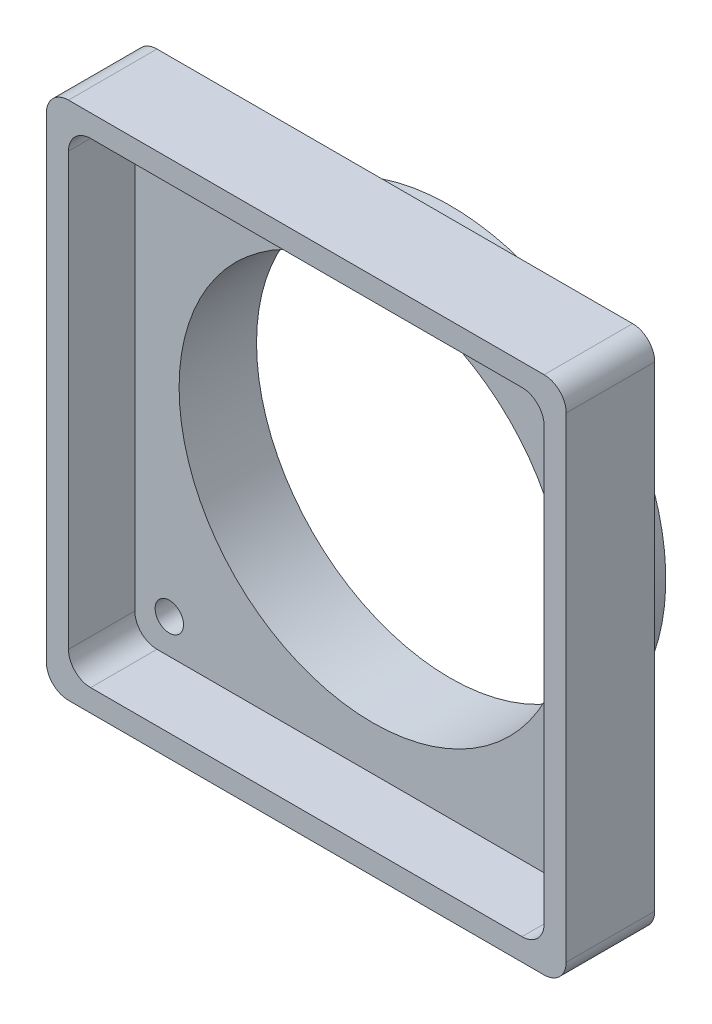
ISO-10303-21;
HEADER;
FILE_DESCRIPTION(('STEP AP214'),'2;1');
FILE_NAME('part.step','',(''),(''),'','','');
FILE_SCHEMA(('AUTOMOTIVE_DESIGN { 1 0 10303 214 1 1 1 1 }'));
ENDSEC;
DATA;
#1=APPLICATION_CONTEXT('core data for automotive mechanical design processes');
#2=APPLICATION_PROTOCOL_DEFINITION('international standard','automotive_design',2000,#1);
#3=PRODUCT_CONTEXT('',#1,'mechanical');
#4=PRODUCT('Part','Part','',(#3));
#5=PRODUCT_RELATED_PRODUCT_CATEGORY('part','',(#4));
#6=PRODUCT_DEFINITION_FORMATION('','',#4);
#7=PRODUCT_DEFINITION_CONTEXT('part definition',#1,'design');
#8=PRODUCT_DEFINITION('design','',#6,#7);
#9=PRODUCT_DEFINITION_SHAPE('','',#8);
#10=(LENGTH_UNIT() NAMED_UNIT(*) SI_UNIT(.MILLI.,.METRE.));
#11=(NAMED_UNIT(*) PLANE_ANGLE_UNIT() SI_UNIT($,.RADIAN.));
#12=(NAMED_UNIT(*) SI_UNIT($,.STERADIAN.) SOLID_ANGLE_UNIT());
#13=UNCERTAINTY_MEASURE_WITH_UNIT(LENGTH_MEASURE(1.E-05),#10,'distance_accuracy_value','');
#14=(GEOMETRIC_REPRESENTATION_CONTEXT(3) GLOBAL_UNCERTAINTY_ASSIGNED_CONTEXT((#13)) GLOBAL_UNIT_ASSIGNED_CONTEXT((#10,
#11,#12)) REPRESENTATION_CONTEXT('',''));
#15=CARTESIAN_POINT('',(0.,0.,0.));
#16=DIRECTION('',(0.,0.,1.));
#17=DIRECTION('',(1.,0.,0.));
#18=AXIS2_PLACEMENT_3D('',#15,#16,#17);
#19=CARTESIAN_POINT('',(0.,0.,8.89));
#20=DIRECTION('',(0.,0.,-1.));
#21=DIRECTION('',(-1.,0.,0.));
#22=AXIS2_PLACEMENT_3D('',#19,#20,#21);
#23=PLANE('',#22);
#24=CARTESIAN_POINT('',(23.3486659147796,23.34866591478,8.89));
#25=DIRECTION('',(0.,0.,1.));
#26=DIRECTION('',(1.,0.,0.));
#27=AXIS2_PLACEMENT_3D('',#24,#25,#26);
#28=CIRCLE('',#27,1.63195);
#29=CARTESIAN_POINT('',(24.9806159147796,23.34866591478,8.89));
#30=VERTEX_POINT('',#29);
#31=EDGE_CURVE('E289',#30,#30,#28,.T.);
#32=ORIENTED_EDGE('',*,*,#31,.F.);
#33=EDGE_LOOP('',(#32));
#34=FACE_BOUND('',#33,.T.);
#35=CARTESIAN_POINT('',(-23.3486659147798,-23.3486659147798,8.89));
#36=DIRECTION('',(0.,0.,1.));
#37=DIRECTION('',(1.,0.,0.));
#38=AXIS2_PLACEMENT_3D('',#35,#36,#37);
#39=CIRCLE('',#38,1.63195);
#40=CARTESIAN_POINT('',(-21.7167159147798,-23.3486659147798,8.89));
#41=VERTEX_POINT('',#40);
#42=EDGE_CURVE('E286',#41,#41,#39,.T.);
#43=ORIENTED_EDGE('',*,*,#42,.F.);
#44=EDGE_LOOP('',(#43));
#45=FACE_BOUND('',#44,.T.);
#46=CARTESIAN_POINT('',(-23.3486659147798,23.3486659147798,8.89));
#47=DIRECTION('',(0.,0.,1.));
#48=DIRECTION('',(1.,0.,0.));
#49=AXIS2_PLACEMENT_3D('',#46,#47,#48);
#50=CIRCLE('',#49,1.63195);
#51=CARTESIAN_POINT('',(-21.7167159147798,23.3486659147798,8.89));
#52=VERTEX_POINT('',#51);
#53=EDGE_CURVE('E297',#52,#52,#50,.T.);
#54=ORIENTED_EDGE('',*,*,#53,.F.);
#55=EDGE_LOOP('',(#54));
#56=FACE_BOUND('',#55,.T.);
#57=CARTESIAN_POINT('',(-24.765,-24.765,8.89));
#58=DIRECTION('',(0.,0.,-1.));
#59=DIRECTION('',(-1.,0.,0.));
#60=AXIS2_PLACEMENT_3D('',#57,#58,#59);
#61=CIRCLE('',#60,2.54);
#62=CARTESIAN_POINT('',(-27.305,-24.765,8.89));
#63=VERTEX_POINT('',#62);
#64=CARTESIAN_POINT('',(-24.765,-27.305,8.89));
#65=VERTEX_POINT('',#64);
#66=EDGE_CURVE('E172',#63,#65,#61,.F.);
#67=ORIENTED_EDGE('',*,*,#66,.T.);
#68=DIRECTION('',(1.,0.,0.));
#69=VECTOR('',#68,1.);
#70=CARTESIAN_POINT('',(24.765,-27.305,8.89));
#71=LINE('',#70,#69);
#72=CARTESIAN_POINT('',(24.765,-27.305,8.89));
#73=VERTEX_POINT('',#72);
#74=EDGE_CURVE('E164',#65,#73,#71,.T.);
#75=ORIENTED_EDGE('',*,*,#74,.T.);
#76=CARTESIAN_POINT('',(24.765,-24.765,8.89));
#77=DIRECTION('',(0.,0.,-1.));
#78=DIRECTION('',(-1.,0.,0.));
#79=AXIS2_PLACEMENT_3D('',#76,#77,#78);
#80=CIRCLE('',#79,2.54);
#81=CARTESIAN_POINT('',(27.305,-24.765,8.89));
#82=VERTEX_POINT('',#81);
#83=EDGE_CURVE('E151',#73,#82,#80,.F.);
#84=ORIENTED_EDGE('',*,*,#83,.T.);
#85=DIRECTION('',(0.,1.,0.));
#86=VECTOR('',#85,1.);
#87=CARTESIAN_POINT('',(27.305,-24.765,8.89));
#88=LINE('',#87,#86);
#89=CARTESIAN_POINT('',(27.305,24.765,8.89));
#90=VERTEX_POINT('',#89);
#91=EDGE_CURVE('E199',#82,#90,#88,.T.);
#92=ORIENTED_EDGE('',*,*,#91,.T.);
#93=CARTESIAN_POINT('',(24.765,24.765,8.89));
#94=DIRECTION('',(0.,0.,-1.));
#95=DIRECTION('',(-1.,0.,0.));
#96=AXIS2_PLACEMENT_3D('',#93,#94,#95);
#97=CIRCLE('',#96,2.54);
#98=CARTESIAN_POINT('',(24.765,27.305,8.89));
#99=VERTEX_POINT('',#98);
#100=EDGE_CURVE('E195',#90,#99,#97,.F.);
#101=ORIENTED_EDGE('',*,*,#100,.T.);
#102=DIRECTION('',(-1.,0.,0.));
#103=VECTOR('',#102,1.);
#104=CARTESIAN_POINT('',(24.765,27.305,8.89));
#105=LINE('',#104,#103);
#106=CARTESIAN_POINT('',(-24.765,27.305,8.89));
#107=VERTEX_POINT('',#106);
#108=EDGE_CURVE('E191',#99,#107,#105,.T.);
#109=ORIENTED_EDGE('',*,*,#108,.T.);
#110=CARTESIAN_POINT('',(-24.765,24.765,8.89));
#111=DIRECTION('',(0.,0.,-1.));
#112=DIRECTION('',(-1.,0.,0.));
#113=AXIS2_PLACEMENT_3D('',#110,#111,#112);
#114=CIRCLE('',#113,2.54);
#115=CARTESIAN_POINT('',(-27.305,24.765,8.89));
#116=VERTEX_POINT('',#115);
#117=EDGE_CURVE('E187',#107,#116,#114,.F.);
#118=ORIENTED_EDGE('',*,*,#117,.T.);
#119=DIRECTION('',(0.,-1.,0.));
#120=VECTOR('',#119,1.);
#121=CARTESIAN_POINT('',(-27.305,-24.765,8.89));
#122=LINE('',#121,#120);
#123=EDGE_CURVE('E184',#116,#63,#122,.T.);
#124=ORIENTED_EDGE('',*,*,#123,.T.);
#125=EDGE_LOOP('',(#67,#75,#84,#92,#101,#109,#118,#124));
#126=FACE_BOUND('',#125,.T.);
#127=CARTESIAN_POINT('',(0.,0.,8.89));
#128=DIRECTION('',(0.,0.,-1.));
#129=DIRECTION('',(-1.,0.,0.));
#130=AXIS2_PLACEMENT_3D('',#127,#128,#129);
#131=CIRCLE('',#130,22.225);
#132=CARTESIAN_POINT('',(-22.225,0.,8.89));
#133=VERTEX_POINT('',#132);
#134=EDGE_CURVE('E208',#133,#133,#131,.F.);
#135=ORIENTED_EDGE('',*,*,#134,.F.);
#136=EDGE_LOOP('',(#135));
#137=FACE_BOUND('',#136,.T.);
#138=CARTESIAN_POINT('',(23.3486659147798,-23.3486659147798,8.89));
#139=DIRECTION('',(0.,0.,1.));
#140=DIRECTION('',(1.,0.,0.));
#141=AXIS2_PLACEMENT_3D('',#138,#139,#140);
#142=CIRCLE('',#141,1.63195);
#143=CARTESIAN_POINT('',(24.9806159147798,-23.3486659147798,8.89));
#144=VERTEX_POINT('',#143);
#145=EDGE_CURVE('E281',#144,#144,#142,.T.);
#146=ORIENTED_EDGE('',*,*,#145,.F.);
#147=EDGE_LOOP('',(#146));
#148=FACE_BOUND('',#147,.T.);
#149=ADVANCED_FACE('F36',(#34,#45,#56,#126,#137,#148),#23,.F.);
#150=CARTESIAN_POINT('',(-27.305,-27.305,16.51));
#151=DIRECTION('',(0.,0.,-1.));
#152=DIRECTION('',(-1.,0.,0.));
#153=AXIS2_PLACEMENT_3D('',#150,#151,#152);
#154=CYLINDRICAL_SURFACE('',#153,2.54);
#155=CARTESIAN_POINT('',(-27.305,-27.305,6.35));
#156=DIRECTION('',(0.,0.,-1.));
#157=DIRECTION('',(-1.,0.,0.));
#158=AXIS2_PLACEMENT_3D('',#155,#156,#157);
#159=CIRCLE('',#158,2.54);
#160=CARTESIAN_POINT('',(-27.305,-29.845,6.35));
#161=VERTEX_POINT('',#160);
#162=CARTESIAN_POINT('',(-29.845,-27.305,6.35));
#163=VERTEX_POINT('',#162);
#164=EDGE_CURVE('E60',#161,#163,#159,.T.);
#165=ORIENTED_EDGE('',*,*,#164,.F.);
#166=DIRECTION('',(0.,0.,-1.));
#167=VECTOR('',#166,1.);
#168=CARTESIAN_POINT('',(-27.305,-29.845,16.51));
#169=LINE('',#168,#167);
#170=CARTESIAN_POINT('',(-27.305,-29.845,16.51));
#171=VERTEX_POINT('',#170);
#172=EDGE_CURVE('E45',#171,#161,#169,.T.);
#173=ORIENTED_EDGE('',*,*,#172,.F.);
#174=CARTESIAN_POINT('',(-27.305,-27.305,16.51));
#175=DIRECTION('',(0.,0.,1.));
#176=DIRECTION('',(1.,0.,0.));
#177=AXIS2_PLACEMENT_3D('',#174,#175,#176);
#178=CIRCLE('',#177,2.54);
#179=CARTESIAN_POINT('',(-29.845,-27.305,16.51));
#180=VERTEX_POINT('',#179);
#181=EDGE_CURVE('E231',#180,#171,#178,.T.);
#182=ORIENTED_EDGE('',*,*,#181,.F.);
#183=DIRECTION('',(0.,0.,-1.));
#184=VECTOR('',#183,1.);
#185=CARTESIAN_POINT('',(-29.845,-27.305,16.51));
#186=LINE('',#185,#184);
#187=EDGE_CURVE('E248',#180,#163,#186,.T.);
#188=ORIENTED_EDGE('',*,*,#187,.T.);
#189=EDGE_LOOP('',(#165,#173,#182,#188));
#190=FACE_BOUND('',#189,.T.);
#191=ADVANCED_FACE('F38',(#190),#154,.T.);
#192=CARTESIAN_POINT('',(-27.305,-29.845,16.51));
#193=DIRECTION('',(0.,1.,0.));
#194=DIRECTION('',(0.,0.,1.));
#195=AXIS2_PLACEMENT_3D('',#192,#193,#194);
#196=PLANE('',#195);
#197=DIRECTION('',(-1.,0.,0.));
#198=VECTOR('',#197,1.);
#199=CARTESIAN_POINT('',(-27.305,-29.845,6.35));
#200=LINE('',#199,#198);
#201=CARTESIAN_POINT('',(27.305,-29.845,6.35));
#202=VERTEX_POINT('',#201);
#203=EDGE_CURVE('E225',#202,#161,#200,.T.);
#204=ORIENTED_EDGE('',*,*,#203,.F.);
#205=DIRECTION('',(0.,0.,-1.));
#206=VECTOR('',#205,1.);
#207=CARTESIAN_POINT('',(27.305,-29.845,16.51));
#208=LINE('',#207,#206);
#209=CARTESIAN_POINT('',(27.305,-29.845,16.51));
#210=VERTEX_POINT('',#209);
#211=EDGE_CURVE('E266',#210,#202,#208,.T.);
#212=ORIENTED_EDGE('',*,*,#211,.F.);
#213=DIRECTION('',(1.,0.,0.));
#214=VECTOR('',#213,1.);
#215=CARTESIAN_POINT('',(-27.305,-29.845,16.51));
#216=LINE('',#215,#214);
#217=EDGE_CURVE('E234',#171,#210,#216,.T.);
#218=ORIENTED_EDGE('',*,*,#217,.F.);
#219=ORIENTED_EDGE('',*,*,#172,.T.);
#220=EDGE_LOOP('',(#204,#212,#218,#219));
#221=FACE_BOUND('',#220,.T.);
#222=ADVANCED_FACE('F398',(#221),#196,.F.);
#223=CARTESIAN_POINT('',(27.305,-27.305,16.51));
#224=DIRECTION('',(0.,0.,-1.));
#225=DIRECTION('',(-1.,0.,0.));
#226=AXIS2_PLACEMENT_3D('',#223,#224,#225);
#227=CYLINDRICAL_SURFACE('',#226,2.54);
#228=CARTESIAN_POINT('',(27.305,-27.305,6.35));
#229=DIRECTION('',(0.,0.,-1.));
#230=DIRECTION('',(-1.,0.,0.));
#231=AXIS2_PLACEMENT_3D('',#228,#229,#230);
#232=CIRCLE('',#231,2.54);
#233=CARTESIAN_POINT('',(29.845,-27.305,6.35));
#234=VERTEX_POINT('',#233);
#235=EDGE_CURVE('E223',#234,#202,#232,.T.);
#236=ORIENTED_EDGE('',*,*,#235,.F.);
#237=DIRECTION('',(0.,0.,-1.));
#238=VECTOR('',#237,1.);
#239=CARTESIAN_POINT('',(29.845,-27.305,16.51));
#240=LINE('',#239,#238);
#241=CARTESIAN_POINT('',(29.845,-27.305,16.51));
#242=VERTEX_POINT('',#241);
#243=EDGE_CURVE('E263',#242,#234,#240,.T.);
#244=ORIENTED_EDGE('',*,*,#243,.F.);
#245=CARTESIAN_POINT('',(27.305,-27.305,16.51));
#246=DIRECTION('',(0.,0.,1.));
#247=DIRECTION('',(1.,0.,0.));
#248=AXIS2_PLACEMENT_3D('',#245,#246,#247);
#249=CIRCLE('',#248,2.54);
#250=EDGE_CURVE('E236',#210,#242,#249,.T.);
#251=ORIENTED_EDGE('',*,*,#250,.F.);
#252=ORIENTED_EDGE('',*,*,#211,.T.);
#253=EDGE_LOOP('',(#236,#244,#251,#252));
#254=FACE_BOUND('',#253,.T.);
#255=ADVANCED_FACE('F395',(#254),#227,.T.);
#256=CARTESIAN_POINT('',(29.845,27.305,16.51));
#257=DIRECTION('',(-1.,0.,0.));
#258=DIRECTION('',(0.,-1.,0.));
#259=AXIS2_PLACEMENT_3D('',#256,#257,#258);
#260=PLANE('',#259);
#261=DIRECTION('',(0.,-1.,0.));
#262=VECTOR('',#261,1.);
#263=CARTESIAN_POINT('',(29.845,27.305,6.35));
#264=LINE('',#263,#262);
#265=CARTESIAN_POINT('',(29.845,27.305,6.35));
#266=VERTEX_POINT('',#265);
#267=EDGE_CURVE('E221',#266,#234,#264,.T.);
#268=ORIENTED_EDGE('',*,*,#267,.F.);
#269=DIRECTION('',(0.,0.,-1.));
#270=VECTOR('',#269,1.);
#271=CARTESIAN_POINT('',(29.845,27.305,16.51));
#272=LINE('',#271,#270);
#273=CARTESIAN_POINT('',(29.845,27.305,16.51));
#274=VERTEX_POINT('',#273);
#275=EDGE_CURVE('E260',#274,#266,#272,.T.);
#276=ORIENTED_EDGE('',*,*,#275,.F.);
#277=DIRECTION('',(0.,1.,0.));
#278=VECTOR('',#277,1.);
#279=CARTESIAN_POINT('',(29.845,27.305,16.51));
#280=LINE('',#279,#278);
#281=EDGE_CURVE('E238',#242,#274,#280,.T.);
#282=ORIENTED_EDGE('',*,*,#281,.F.);
#283=ORIENTED_EDGE('',*,*,#243,.T.);
#284=EDGE_LOOP('',(#268,#276,#282,#283));
#285=FACE_BOUND('',#284,.T.);
#286=ADVANCED_FACE('F391',(#285),#260,.F.);
#287=CARTESIAN_POINT('',(27.305,27.305,16.51));
#288=DIRECTION('',(0.,0.,-1.));
#289=DIRECTION('',(-1.,0.,0.));
#290=AXIS2_PLACEMENT_3D('',#287,#288,#289);
#291=CYLINDRICAL_SURFACE('',#290,2.54);
#292=CARTESIAN_POINT('',(27.305,27.305,6.35));
#293=DIRECTION('',(0.,0.,-1.));
#294=DIRECTION('',(-1.,0.,0.));
#295=AXIS2_PLACEMENT_3D('',#292,#293,#294);
#296=CIRCLE('',#295,2.54);
#297=CARTESIAN_POINT('',(27.305,29.845,6.35));
#298=VERTEX_POINT('',#297);
#299=EDGE_CURVE('E219',#298,#266,#296,.T.);
#300=ORIENTED_EDGE('',*,*,#299,.F.);
#301=DIRECTION('',(0.,0.,-1.));
#302=VECTOR('',#301,1.);
#303=CARTESIAN_POINT('',(27.305,29.845,16.51));
#304=LINE('',#303,#302);
#305=CARTESIAN_POINT('',(27.305,29.845,16.51));
#306=VERTEX_POINT('',#305);
#307=EDGE_CURVE('E257',#306,#298,#304,.T.);
#308=ORIENTED_EDGE('',*,*,#307,.F.);
#309=CARTESIAN_POINT('',(27.305,27.305,16.51));
#310=DIRECTION('',(0.,0.,1.));
#311=DIRECTION('',(-1.,0.,0.));
#312=AXIS2_PLACEMENT_3D('',#309,#310,#311);
#313=CIRCLE('',#312,2.54);
#314=EDGE_CURVE('E240',#274,#306,#313,.T.);
#315=ORIENTED_EDGE('',*,*,#314,.F.);
#316=ORIENTED_EDGE('',*,*,#275,.T.);
#317=EDGE_LOOP('',(#300,#308,#315,#316));
#318=FACE_BOUND('',#317,.T.);
#319=ADVANCED_FACE('F387',(#318),#291,.T.);
#320=CARTESIAN_POINT('',(-27.305,29.845,16.51));
#321=DIRECTION('',(0.,-1.,0.));
#322=DIRECTION('',(0.,0.,-1.));
#323=AXIS2_PLACEMENT_3D('',#320,#321,#322);
#324=PLANE('',#323);
#325=DIRECTION('',(1.,0.,0.));
#326=VECTOR('',#325,1.);
#327=CARTESIAN_POINT('',(-27.305,29.845,6.35));
#328=LINE('',#327,#326);
#329=CARTESIAN_POINT('',(-27.305,29.845,6.35));
#330=VERTEX_POINT('',#329);
#331=EDGE_CURVE('E217',#330,#298,#328,.T.);
#332=ORIENTED_EDGE('',*,*,#331,.F.);
#333=DIRECTION('',(0.,0.,-1.));
#334=VECTOR('',#333,1.);
#335=CARTESIAN_POINT('',(-27.305,29.845,16.51));
#336=LINE('',#335,#334);
#337=CARTESIAN_POINT('',(-27.305,29.845,16.51));
#338=VERTEX_POINT('',#337);
#339=EDGE_CURVE('E254',#338,#330,#336,.T.);
#340=ORIENTED_EDGE('',*,*,#339,.F.);
#341=DIRECTION('',(-1.,0.,0.));
#342=VECTOR('',#341,1.);
#343=CARTESIAN_POINT('',(-27.305,29.845,16.51));
#344=LINE('',#343,#342);
#345=EDGE_CURVE('E242',#306,#338,#344,.T.);
#346=ORIENTED_EDGE('',*,*,#345,.F.);
#347=ORIENTED_EDGE('',*,*,#307,.T.);
#348=EDGE_LOOP('',(#332,#340,#346,#347));
#349=FACE_BOUND('',#348,.T.);
#350=ADVANCED_FACE('F383',(#349),#324,.F.);
#351=CARTESIAN_POINT('',(-27.305,27.305,16.51));
#352=DIRECTION('',(0.,0.,-1.));
#353=DIRECTION('',(-1.,0.,0.));
#354=AXIS2_PLACEMENT_3D('',#351,#352,#353);
#355=CYLINDRICAL_SURFACE('',#354,2.54);
#356=CARTESIAN_POINT('',(-27.305,27.305,6.35));
#357=DIRECTION('',(0.,0.,-1.));
#358=DIRECTION('',(-1.,0.,0.));
#359=AXIS2_PLACEMENT_3D('',#356,#357,#358);
#360=CIRCLE('',#359,2.54);
#361=CARTESIAN_POINT('',(-29.845,27.305,6.35));
#362=VERTEX_POINT('',#361);
#363=EDGE_CURVE('E212',#362,#330,#360,.T.);
#364=ORIENTED_EDGE('',*,*,#363,.F.);
#365=DIRECTION('',(0.,0.,-1.));
#366=VECTOR('',#365,1.);
#367=CARTESIAN_POINT('',(-29.845,27.305,16.51));
#368=LINE('',#367,#366);
#369=CARTESIAN_POINT('',(-29.845,27.305,16.51));
#370=VERTEX_POINT('',#369);
#371=EDGE_CURVE('E251',#370,#362,#368,.T.);
#372=ORIENTED_EDGE('',*,*,#371,.F.);
#373=CARTESIAN_POINT('',(-27.305,27.305,16.51));
#374=DIRECTION('',(0.,0.,1.));
#375=DIRECTION('',(1.,0.,0.));
#376=AXIS2_PLACEMENT_3D('',#373,#374,#375);
#377=CIRCLE('',#376,2.54);
#378=EDGE_CURVE('E244',#338,#370,#377,.T.);
#379=ORIENTED_EDGE('',*,*,#378,.F.);
#380=ORIENTED_EDGE('',*,*,#339,.T.);
#381=EDGE_LOOP('',(#364,#372,#379,#380));
#382=FACE_BOUND('',#381,.T.);
#383=ADVANCED_FACE('F379',(#382),#355,.T.);
#384=CARTESIAN_POINT('',(-29.845,27.305,16.51));
#385=DIRECTION('',(1.,0.,0.));
#386=DIRECTION('',(0.,1.,0.));
#387=AXIS2_PLACEMENT_3D('',#384,#385,#386);
#388=PLANE('',#387);
#389=DIRECTION('',(0.,1.,0.));
#390=VECTOR('',#389,1.);
#391=CARTESIAN_POINT('',(-29.845,27.305,6.35));
#392=LINE('',#391,#390);
#393=EDGE_CURVE('E13',#163,#362,#392,.T.);
#394=ORIENTED_EDGE('',*,*,#393,.F.);
#395=ORIENTED_EDGE('',*,*,#187,.F.);
#396=DIRECTION('',(0.,-1.,0.));
#397=VECTOR('',#396,1.);
#398=CARTESIAN_POINT('',(-29.845,27.305,16.51));
#399=LINE('',#398,#397);
#400=EDGE_CURVE('E246',#370,#180,#399,.T.);
#401=ORIENTED_EDGE('',*,*,#400,.F.);
#402=ORIENTED_EDGE('',*,*,#371,.T.);
#403=EDGE_LOOP('',(#394,#395,#401,#402));
#404=FACE_BOUND('',#403,.T.);
#405=ADVANCED_FACE('F375',(#404),#388,.F.);
#406=CARTESIAN_POINT('',(-27.305,-27.305,0.));
#407=DIRECTION('',(0.,0.,1.));
#408=DIRECTION('',(1.,0.,0.));
#409=AXIS2_PLACEMENT_3D('',#406,#407,#408);
#410=PLANE('',#409);
#411=CARTESIAN_POINT('',(0.,0.,0.));
#412=DIRECTION('',(0.,0.,1.));
#413=DIRECTION('',(1.,0.,0.));
#414=AXIS2_PLACEMENT_3D('',#411,#412,#413);
#415=CIRCLE('',#414,22.225);
#416=CARTESIAN_POINT('',(22.225,0.,0.));
#417=VERTEX_POINT('',#416);
#418=EDGE_CURVE('E228',#417,#417,#415,.T.);
#419=ORIENTED_EDGE('',*,*,#418,.T.);
#420=EDGE_LOOP('',(#419));
#421=FACE_BOUND('',#420,.T.);
#422=CARTESIAN_POINT('',(0.,0.,0.));
#423=DIRECTION('',(0.,0.,-1.));
#424=DIRECTION('',(-1.,0.,0.));
#425=AXIS2_PLACEMENT_3D('',#422,#423,#424);
#426=CIRCLE('',#425,24.765);
#427=CARTESIAN_POINT('',(-24.765,0.,0.));
#428=VERTEX_POINT('',#427);
#429=EDGE_CURVE('E213',#428,#428,#426,.T.);
#430=ORIENTED_EDGE('',*,*,#429,.T.);
#431=EDGE_LOOP('',(#430));
#432=FACE_BOUND('',#431,.T.);
#433=ADVANCED_FACE('F372',(#421,#432),#410,.F.);
#434=CARTESIAN_POINT('',(-27.305,-27.305,16.51));
#435=DIRECTION('',(0.,0.,1.));
#436=DIRECTION('',(1.,0.,0.));
#437=AXIS2_PLACEMENT_3D('',#434,#435,#436);
#438=PLANE('',#437);
#439=DIRECTION('',(1.,0.,0.));
#440=VECTOR('',#439,1.);
#441=CARTESIAN_POINT('',(24.765,-27.305,16.51));
#442=LINE('',#441,#440);
#443=CARTESIAN_POINT('',(-24.765,-27.305,16.51));
#444=VERTEX_POINT('',#443);
#445=CARTESIAN_POINT('',(24.765,-27.305,16.51));
#446=VERTEX_POINT('',#445);
#447=EDGE_CURVE('E167',#444,#446,#442,.T.);
#448=ORIENTED_EDGE('',*,*,#447,.F.);
#449=CARTESIAN_POINT('',(-24.765,-24.765,16.51));
#450=DIRECTION('',(0.,0.,1.));
#451=DIRECTION('',(-1.,0.,0.));
#452=AXIS2_PLACEMENT_3D('',#449,#450,#451);
#453=CIRCLE('',#452,2.54);
#454=CARTESIAN_POINT('',(-27.305,-24.765,16.51));
#455=VERTEX_POINT('',#454);
#456=EDGE_CURVE('E179',#455,#444,#453,.T.);
#457=ORIENTED_EDGE('',*,*,#456,.F.);
#458=DIRECTION('',(0.,-1.,0.));
#459=VECTOR('',#458,1.);
#460=CARTESIAN_POINT('',(-27.305,-24.765,16.51));
#461=LINE('',#460,#459);
#462=CARTESIAN_POINT('',(-27.305,24.765,16.51));
#463=VERTEX_POINT('',#462);
#464=EDGE_CURVE('E53',#463,#455,#461,.T.);
#465=ORIENTED_EDGE('',*,*,#464,.F.);
#466=CARTESIAN_POINT('',(-24.765,24.765,16.51));
#467=DIRECTION('',(0.,0.,1.));
#468=DIRECTION('',(1.,0.,0.));
#469=AXIS2_PLACEMENT_3D('',#466,#467,#468);
#470=CIRCLE('',#469,2.54);
#471=CARTESIAN_POINT('',(-24.765,27.305,16.51));
#472=VERTEX_POINT('',#471);
#473=EDGE_CURVE('E175',#472,#463,#470,.T.);
#474=ORIENTED_EDGE('',*,*,#473,.F.);
#475=DIRECTION('',(-1.,0.,0.));
#476=VECTOR('',#475,1.);
#477=CARTESIAN_POINT('',(24.765,27.305,16.51));
#478=LINE('',#477,#476);
#479=CARTESIAN_POINT('',(24.765,27.305,16.51));
#480=VERTEX_POINT('',#479);
#481=EDGE_CURVE('E305',#480,#472,#478,.T.);
#482=ORIENTED_EDGE('',*,*,#481,.F.);
#483=CARTESIAN_POINT('',(24.765,24.765,16.51));
#484=DIRECTION('',(0.,0.,1.));
#485=DIRECTION('',(1.,0.,0.));
#486=AXIS2_PLACEMENT_3D('',#483,#484,#485);
#487=CIRCLE('',#486,2.54);
#488=CARTESIAN_POINT('',(27.305,24.765,16.51));
#489=VERTEX_POINT('',#488);
#490=EDGE_CURVE('E308',#489,#480,#487,.T.);
#491=ORIENTED_EDGE('',*,*,#490,.F.);
#492=DIRECTION('',(0.,1.,0.));
#493=VECTOR('',#492,1.);
#494=CARTESIAN_POINT('',(27.305,-24.765,16.51));
#495=LINE('',#494,#493);
#496=CARTESIAN_POINT('',(27.305,-24.765,16.51));
#497=VERTEX_POINT('',#496);
#498=EDGE_CURVE('E311',#497,#489,#495,.T.);
#499=ORIENTED_EDGE('',*,*,#498,.F.);
#500=CARTESIAN_POINT('',(24.765,-24.765,16.51));
#501=DIRECTION('',(0.,0.,1.));
#502=DIRECTION('',(1.,0.,0.));
#503=AXIS2_PLACEMENT_3D('',#500,#501,#502);
#504=CIRCLE('',#503,2.54);
#505=EDGE_CURVE('E314',#446,#497,#504,.T.);
#506=ORIENTED_EDGE('',*,*,#505,.F.);
#507=EDGE_LOOP('',(#448,#457,#465,#474,#482,#491,#499,#506));
#508=FACE_BOUND('',#507,.T.);
#509=ORIENTED_EDGE('',*,*,#181,.T.);
#510=ORIENTED_EDGE('',*,*,#217,.T.);
#511=ORIENTED_EDGE('',*,*,#250,.T.);
#512=ORIENTED_EDGE('',*,*,#281,.T.);
#513=ORIENTED_EDGE('',*,*,#314,.T.);
#514=ORIENTED_EDGE('',*,*,#345,.T.);
#515=ORIENTED_EDGE('',*,*,#378,.T.);
#516=ORIENTED_EDGE('',*,*,#400,.T.);
#517=EDGE_LOOP('',(#509,#510,#511,#512,#513,#514,#515,#516));
#518=FACE_BOUND('',#517,.T.);
#519=ADVANCED_FACE('F320',(#508,#518),#438,.T.);
#520=CARTESIAN_POINT('',(0.,0.,0.));
#521=DIRECTION('',(0.,0.,1.));
#522=DIRECTION('',(1.,0.,0.));
#523=AXIS2_PLACEMENT_3D('',#520,#521,#522);
#524=CYLINDRICAL_SURFACE('',#523,22.225);
#525=ORIENTED_EDGE('',*,*,#134,.T.);
#526=EDGE_LOOP('',(#525));
#527=FACE_BOUND('',#526,.T.);
#528=ORIENTED_EDGE('',*,*,#418,.F.);
#529=EDGE_LOOP('',(#528));
#530=FACE_BOUND('',#529,.T.);
#531=ADVANCED_FACE('F273',(#527,#530),#524,.F.);
#532=CARTESIAN_POINT('',(0.,0.,6.35));
#533=DIRECTION('',(0.,0.,-1.));
#534=DIRECTION('',(-1.,0.,0.));
#535=AXIS2_PLACEMENT_3D('',#532,#533,#534);
#536=PLANE('',#535);
#537=CARTESIAN_POINT('',(23.3486659147796,23.34866591478,6.35));
#538=DIRECTION('',(0.,0.,-1.));
#539=DIRECTION('',(-1.,0.,0.));
#540=AXIS2_PLACEMENT_3D('',#537,#538,#539);
#541=CIRCLE('',#540,1.63195);
#542=CARTESIAN_POINT('',(21.7167159147796,23.34866591478,6.35));
#543=VERTEX_POINT('',#542);
#544=EDGE_CURVE('E40',#543,#543,#541,.T.);
#545=ORIENTED_EDGE('',*,*,#544,.F.);
#546=EDGE_LOOP('',(#545));
#547=FACE_BOUND('',#546,.T.);
#548=CARTESIAN_POINT('',(23.3486659147798,-23.3486659147798,6.35));
#549=DIRECTION('',(0.,0.,-1.));
#550=DIRECTION('',(-1.,0.,0.));
#551=AXIS2_PLACEMENT_3D('',#548,#549,#550);
#552=CIRCLE('',#551,1.63195);
#553=CARTESIAN_POINT('',(21.7167159147798,-23.3486659147798,6.35));
#554=VERTEX_POINT('',#553);
#555=EDGE_CURVE('E283',#554,#554,#552,.T.);
#556=ORIENTED_EDGE('',*,*,#555,.F.);
#557=EDGE_LOOP('',(#556));
#558=FACE_BOUND('',#557,.T.);
#559=CARTESIAN_POINT('',(-23.3486659147798,-23.3486659147798,6.35));
#560=DIRECTION('',(0.,0.,-1.));
#561=DIRECTION('',(-1.,0.,0.));
#562=AXIS2_PLACEMENT_3D('',#559,#560,#561);
#563=CIRCLE('',#562,1.63195);
#564=CARTESIAN_POINT('',(-24.9806159147798,-23.3486659147798,6.35));
#565=VERTEX_POINT('',#564);
#566=EDGE_CURVE('E294',#565,#565,#563,.T.);
#567=ORIENTED_EDGE('',*,*,#566,.F.);
#568=EDGE_LOOP('',(#567));
#569=FACE_BOUND('',#568,.T.);
#570=CARTESIAN_POINT('',(-23.3486659147798,23.3486659147798,6.35));
#571=DIRECTION('',(0.,0.,-1.));
#572=DIRECTION('',(-1.,0.,0.));
#573=AXIS2_PLACEMENT_3D('',#570,#571,#572);
#574=CIRCLE('',#573,1.63195);
#575=CARTESIAN_POINT('',(-24.9806159147798,23.3486659147798,6.35));
#576=VERTEX_POINT('',#575);
#577=EDGE_CURVE('E300',#576,#576,#574,.T.);
#578=ORIENTED_EDGE('',*,*,#577,.F.);
#579=EDGE_LOOP('',(#578));
#580=FACE_BOUND('',#579,.T.);
#581=CARTESIAN_POINT('',(0.,0.,6.35));
#582=DIRECTION('',(0.,0.,-1.));
#583=DIRECTION('',(-1.,0.,0.));
#584=AXIS2_PLACEMENT_3D('',#581,#582,#583);
#585=CIRCLE('',#584,24.765);
#586=CARTESIAN_POINT('',(-24.765,0.,6.35));
#587=VERTEX_POINT('',#586);
#588=EDGE_CURVE('E209',#587,#587,#585,.T.);
#589=ORIENTED_EDGE('',*,*,#588,.F.);
#590=EDGE_LOOP('',(#589));
#591=FACE_BOUND('',#590,.T.);
#592=ORIENTED_EDGE('',*,*,#164,.T.);
#593=ORIENTED_EDGE('',*,*,#393,.T.);
#594=ORIENTED_EDGE('',*,*,#363,.T.);
#595=ORIENTED_EDGE('',*,*,#331,.T.);
#596=ORIENTED_EDGE('',*,*,#299,.T.);
#597=ORIENTED_EDGE('',*,*,#267,.T.);
#598=ORIENTED_EDGE('',*,*,#235,.T.);
#599=ORIENTED_EDGE('',*,*,#203,.T.);
#600=EDGE_LOOP('',(#592,#593,#594,#595,#596,#597,#598,#599));
#601=FACE_BOUND('',#600,.T.);
#602=ADVANCED_FACE('F363',(#547,#558,#569,#580,#591,#601),#536,.T.);
#603=CARTESIAN_POINT('',(0.,0.,6.35));
#604=DIRECTION('',(0.,0.,-1.));
#605=DIRECTION('',(-1.,0.,0.));
#606=AXIS2_PLACEMENT_3D('',#603,#604,#605);
#607=CYLINDRICAL_SURFACE('',#606,24.765);
#608=ORIENTED_EDGE('',*,*,#588,.T.);
#609=EDGE_LOOP('',(#608));
#610=FACE_BOUND('',#609,.T.);
#611=ORIENTED_EDGE('',*,*,#429,.F.);
#612=EDGE_LOOP('',(#611));
#613=FACE_BOUND('',#612,.T.);
#614=ADVANCED_FACE('F359',(#610,#613),#607,.T.);
#615=CARTESIAN_POINT('',(24.765,-27.305,-70.8802026411947));
#616=DIRECTION('',(0.,-1.,0.));
#617=DIRECTION('',(1.,0.,0.));
#618=AXIS2_PLACEMENT_3D('',#615,#616,#617);
#619=PLANE('',#618);
#620=DIRECTION('',(0.,0.,1.));
#621=VECTOR('',#620,1.);
#622=CARTESIAN_POINT('',(-24.765,-27.305,-70.8802026411947));
#623=LINE('',#622,#621);
#624=EDGE_CURVE('E182',#65,#444,#623,.T.);
#625=ORIENTED_EDGE('',*,*,#624,.T.);
#626=ORIENTED_EDGE('',*,*,#447,.T.);
#627=DIRECTION('',(0.,0.,1.));
#628=VECTOR('',#627,1.);
#629=CARTESIAN_POINT('',(24.765,-27.305,-70.8802026411947));
#630=LINE('',#629,#628);
#631=EDGE_CURVE('E155',#73,#446,#630,.T.);
#632=ORIENTED_EDGE('',*,*,#631,.F.);
#633=ORIENTED_EDGE('',*,*,#74,.F.);
#634=EDGE_LOOP('',(#625,#626,#632,#633));
#635=FACE_BOUND('',#634,.T.);
#636=ADVANCED_FACE('F163',(#635),#619,.F.);
#637=CARTESIAN_POINT('',(24.765,-24.765,-70.8802026411947));
#638=DIRECTION('',(0.,0.,1.));
#639=DIRECTION('',(1.,0.,0.));
#640=AXIS2_PLACEMENT_3D('',#637,#638,#639);
#641=CYLINDRICAL_SURFACE('',#640,2.54);
#642=ORIENTED_EDGE('',*,*,#631,.T.);
#643=ORIENTED_EDGE('',*,*,#505,.T.);
#644=DIRECTION('',(0.,0.,1.));
#645=VECTOR('',#644,1.);
#646=CARTESIAN_POINT('',(27.305,-24.765,-70.8802026411947));
#647=LINE('',#646,#645);
#648=EDGE_CURVE('E157',#82,#497,#647,.T.);
#649=ORIENTED_EDGE('',*,*,#648,.F.);
#650=ORIENTED_EDGE('',*,*,#83,.F.);
#651=EDGE_LOOP('',(#642,#643,#649,#650));
#652=FACE_BOUND('',#651,.T.);
#653=ADVANCED_FACE('F153',(#652),#641,.F.);
#654=CARTESIAN_POINT('',(27.305,-24.765,-70.8802026411947));
#655=DIRECTION('',(1.,0.,0.));
#656=DIRECTION('',(0.,1.,0.));
#657=AXIS2_PLACEMENT_3D('',#654,#655,#656);
#658=PLANE('',#657);
#659=ORIENTED_EDGE('',*,*,#648,.T.);
#660=ORIENTED_EDGE('',*,*,#498,.T.);
#661=DIRECTION('',(0.,0.,1.));
#662=VECTOR('',#661,1.);
#663=CARTESIAN_POINT('',(27.305,24.765,-70.8802026411947));
#664=LINE('',#663,#662);
#665=EDGE_CURVE('E198',#90,#489,#664,.T.);
#666=ORIENTED_EDGE('',*,*,#665,.F.);
#667=ORIENTED_EDGE('',*,*,#91,.F.);
#668=EDGE_LOOP('',(#659,#660,#666,#667));
#669=FACE_BOUND('',#668,.T.);
#670=ADVANCED_FACE('F327',(#669),#658,.F.);
#671=CARTESIAN_POINT('',(24.765,24.765,-70.8802026411947));
#672=DIRECTION('',(0.,0.,1.));
#673=DIRECTION('',(1.,0.,0.));
#674=AXIS2_PLACEMENT_3D('',#671,#672,#673);
#675=CYLINDRICAL_SURFACE('',#674,2.54);
#676=ORIENTED_EDGE('',*,*,#665,.T.);
#677=ORIENTED_EDGE('',*,*,#490,.T.);
#678=DIRECTION('',(0.,0.,1.));
#679=VECTOR('',#678,1.);
#680=CARTESIAN_POINT('',(24.765,27.305,-70.8802026411947));
#681=LINE('',#680,#679);
#682=EDGE_CURVE('E194',#99,#480,#681,.T.);
#683=ORIENTED_EDGE('',*,*,#682,.F.);
#684=ORIENTED_EDGE('',*,*,#100,.F.);
#685=EDGE_LOOP('',(#676,#677,#683,#684));
#686=FACE_BOUND('',#685,.T.);
#687=ADVANCED_FACE('F330',(#686),#675,.F.);
#688=CARTESIAN_POINT('',(24.765,27.305,-70.8802026411947));
#689=DIRECTION('',(0.,1.,0.));
#690=DIRECTION('',(-1.,0.,0.));
#691=AXIS2_PLACEMENT_3D('',#688,#689,#690);
#692=PLANE('',#691);
#693=ORIENTED_EDGE('',*,*,#682,.T.);
#694=ORIENTED_EDGE('',*,*,#481,.T.);
#695=DIRECTION('',(0.,0.,1.));
#696=VECTOR('',#695,1.);
#697=CARTESIAN_POINT('',(-24.765,27.305,-70.8802026411947));
#698=LINE('',#697,#696);
#699=EDGE_CURVE('E190',#107,#472,#698,.T.);
#700=ORIENTED_EDGE('',*,*,#699,.F.);
#701=ORIENTED_EDGE('',*,*,#108,.F.);
#702=EDGE_LOOP('',(#693,#694,#700,#701));
#703=FACE_BOUND('',#702,.T.);
#704=ADVANCED_FACE('F332',(#703),#692,.F.);
#705=CARTESIAN_POINT('',(-24.765,24.765,-70.8802026411947));
#706=DIRECTION('',(0.,0.,1.));
#707=DIRECTION('',(1.,0.,0.));
#708=AXIS2_PLACEMENT_3D('',#705,#706,#707);
#709=CYLINDRICAL_SURFACE('',#708,2.54);
#710=ORIENTED_EDGE('',*,*,#699,.T.);
#711=ORIENTED_EDGE('',*,*,#473,.T.);
#712=DIRECTION('',(0.,0.,1.));
#713=VECTOR('',#712,1.);
#714=CARTESIAN_POINT('',(-27.305,24.765,-70.8802026411947));
#715=LINE('',#714,#713);
#716=EDGE_CURVE('E186',#116,#463,#715,.T.);
#717=ORIENTED_EDGE('',*,*,#716,.F.);
#718=ORIENTED_EDGE('',*,*,#117,.F.);
#719=EDGE_LOOP('',(#710,#711,#717,#718));
#720=FACE_BOUND('',#719,.T.);
#721=ADVANCED_FACE('F336',(#720),#709,.F.);
#722=CARTESIAN_POINT('',(-27.305,-24.765,-70.8802026411947));
#723=DIRECTION('',(-1.,0.,0.));
#724=DIRECTION('',(0.,0.,1.));
#725=AXIS2_PLACEMENT_3D('',#722,#723,#724);
#726=PLANE('',#725);
#727=ORIENTED_EDGE('',*,*,#716,.T.);
#728=ORIENTED_EDGE('',*,*,#464,.T.);
#729=DIRECTION('',(0.,0.,1.));
#730=VECTOR('',#729,1.);
#731=CARTESIAN_POINT('',(-27.305,-24.765,-70.8802026411947));
#732=LINE('',#731,#730);
#733=EDGE_CURVE('E183',#63,#455,#732,.T.);
#734=ORIENTED_EDGE('',*,*,#733,.F.);
#735=ORIENTED_EDGE('',*,*,#123,.F.);
#736=EDGE_LOOP('',(#727,#728,#734,#735));
#737=FACE_BOUND('',#736,.T.);
#738=ADVANCED_FACE('F338',(#737),#726,.F.);
#739=CARTESIAN_POINT('',(-24.765,-24.765,-70.8802026411947));
#740=DIRECTION('',(0.,0.,1.));
#741=DIRECTION('',(1.,0.,0.));
#742=AXIS2_PLACEMENT_3D('',#739,#740,#741);
#743=CYLINDRICAL_SURFACE('',#742,2.54);
#744=ORIENTED_EDGE('',*,*,#733,.T.);
#745=ORIENTED_EDGE('',*,*,#456,.T.);
#746=ORIENTED_EDGE('',*,*,#624,.F.);
#747=ORIENTED_EDGE('',*,*,#66,.F.);
#748=EDGE_LOOP('',(#744,#745,#746,#747));
#749=FACE_BOUND('',#748,.T.);
#750=ADVANCED_FACE('F318',(#749),#743,.F.);
#751=CARTESIAN_POINT('',(-23.3486659147798,23.3486659147798,8.89));
#752=DIRECTION('',(0.,0.,1.));
#753=DIRECTION('',(1.,0.,0.));
#754=AXIS2_PLACEMENT_3D('',#751,#752,#753);
#755=CYLINDRICAL_SURFACE('',#754,1.63195);
#756=ORIENTED_EDGE('',*,*,#577,.T.);
#757=EDGE_LOOP('',(#756));
#758=FACE_BOUND('',#757,.T.);
#759=ORIENTED_EDGE('',*,*,#53,.T.);
#760=EDGE_LOOP('',(#759));
#761=FACE_BOUND('',#760,.T.);
#762=ADVANCED_FACE('F345',(#758,#761),#755,.F.);
#763=CARTESIAN_POINT('',(-23.3486659147798,-23.3486659147798,8.89));
#764=DIRECTION('',(0.,0.,1.));
#765=DIRECTION('',(1.,0.,0.));
#766=AXIS2_PLACEMENT_3D('',#763,#764,#765);
#767=CYLINDRICAL_SURFACE('',#766,1.63195);
#768=ORIENTED_EDGE('',*,*,#566,.T.);
#769=EDGE_LOOP('',(#768));
#770=FACE_BOUND('',#769,.T.);
#771=ORIENTED_EDGE('',*,*,#42,.T.);
#772=EDGE_LOOP('',(#771));
#773=FACE_BOUND('',#772,.T.);
#774=ADVANCED_FACE('F451',(#770,#773),#767,.F.);
#775=CARTESIAN_POINT('',(23.3486659147798,-23.3486659147798,8.89));
#776=DIRECTION('',(0.,0.,1.));
#777=DIRECTION('',(1.,0.,0.));
#778=AXIS2_PLACEMENT_3D('',#775,#776,#777);
#779=CYLINDRICAL_SURFACE('',#778,1.63195);
#780=ORIENTED_EDGE('',*,*,#555,.T.);
#781=EDGE_LOOP('',(#780));
#782=FACE_BOUND('',#781,.T.);
#783=ORIENTED_EDGE('',*,*,#145,.T.);
#784=EDGE_LOOP('',(#783));
#785=FACE_BOUND('',#784,.T.);
#786=ADVANCED_FACE('F455',(#782,#785),#779,.F.);
#787=CARTESIAN_POINT('',(23.3486659147796,23.34866591478,8.89));
#788=DIRECTION('',(0.,0.,1.));
#789=DIRECTION('',(1.,0.,0.));
#790=AXIS2_PLACEMENT_3D('',#787,#788,#789);
#791=CYLINDRICAL_SURFACE('',#790,1.63195);
#792=ORIENTED_EDGE('',*,*,#544,.T.);
#793=EDGE_LOOP('',(#792));
#794=FACE_BOUND('',#793,.T.);
#795=ORIENTED_EDGE('',*,*,#31,.T.);
#796=EDGE_LOOP('',(#795));
#797=FACE_BOUND('',#796,.T.);
#798=ADVANCED_FACE('F465',(#794,#797),#791,.F.);
#799=CLOSED_SHELL('',(#149,#191,#222,#255,#286,#319,#350,#383,#405,#433,#519,#531,#602,#614,
#636,#653,#670,#687,#704,#721,#738,#750,#762,#774,#786,#798));
#800=MANIFOLD_SOLID_BREP('B2',#799);
#801=ADVANCED_BREP_SHAPE_REPRESENTATION('',(#18,#800),#14);
#802=SHAPE_DEFINITION_REPRESENTATION(#9,#801);
ENDSEC;
END-ISO-10303-21;
